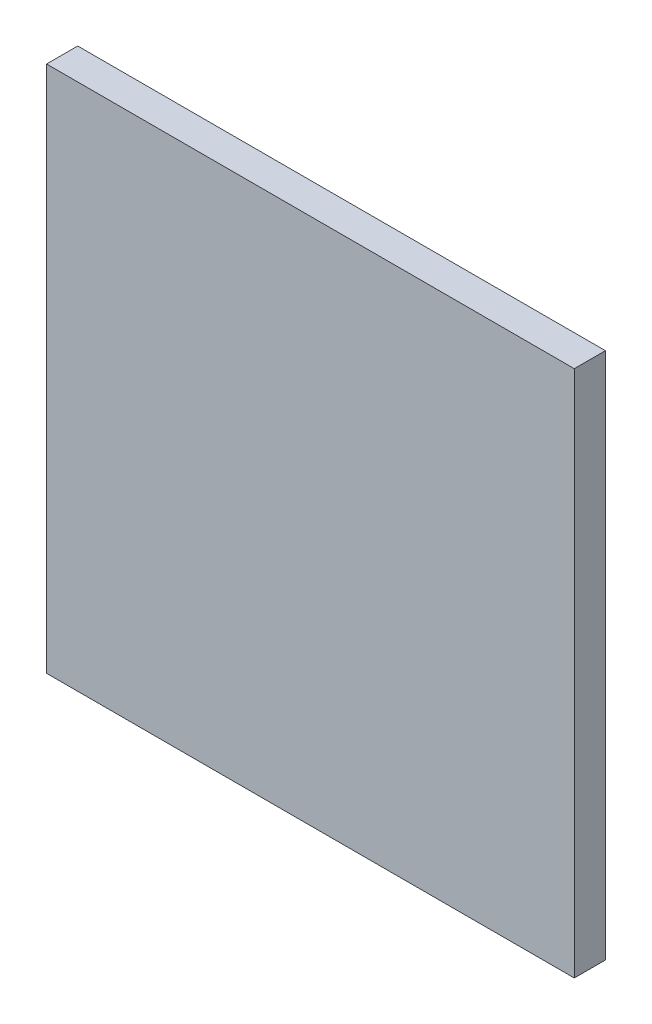
ISO-10303-21;
HEADER;
FILE_DESCRIPTION(('STEP AP214'),'2;1');
FILE_NAME('part.step','',(''),(''),'','','');
FILE_SCHEMA(('AUTOMOTIVE_DESIGN { 1 0 10303 214 1 1 1 1 }'));
ENDSEC;
DATA;
#1=APPLICATION_CONTEXT('core data for automotive mechanical design processes');
#2=APPLICATION_PROTOCOL_DEFINITION('international standard','automotive_design',2000,#1);
#3=PRODUCT_CONTEXT('',#1,'mechanical');
#4=PRODUCT('Part','Part','',(#3));
#5=PRODUCT_RELATED_PRODUCT_CATEGORY('part','',(#4));
#6=PRODUCT_DEFINITION_FORMATION('','',#4);
#7=PRODUCT_DEFINITION_CONTEXT('part definition',#1,'design');
#8=PRODUCT_DEFINITION('design','',#6,#7);
#9=PRODUCT_DEFINITION_SHAPE('','',#8);
#10=(LENGTH_UNIT() NAMED_UNIT(*) SI_UNIT(.MILLI.,.METRE.));
#11=(NAMED_UNIT(*) PLANE_ANGLE_UNIT() SI_UNIT($,.RADIAN.));
#12=(NAMED_UNIT(*) SI_UNIT($,.STERADIAN.) SOLID_ANGLE_UNIT());
#13=UNCERTAINTY_MEASURE_WITH_UNIT(LENGTH_MEASURE(1.E-05),#10,'distance_accuracy_value','');
#14=(GEOMETRIC_REPRESENTATION_CONTEXT(3) GLOBAL_UNCERTAINTY_ASSIGNED_CONTEXT((#13)) GLOBAL_UNIT_ASSIGNED_CONTEXT((#10,
#11,#12)) REPRESENTATION_CONTEXT('',''));
#15=CARTESIAN_POINT('',(0.,0.,0.));
#16=DIRECTION('',(0.,0.,1.));
#17=DIRECTION('',(1.,0.,0.));
#18=AXIS2_PLACEMENT_3D('',#15,#16,#17);
#19=CARTESIAN_POINT('',(-0.432,-0.432,0.));
#20=DIRECTION('',(0.,-1.,0.));
#21=DIRECTION('',(0.,0.,1.));
#22=AXIS2_PLACEMENT_3D('',#19,#20,#21);
#23=PLANE('',#22);
#24=DIRECTION('',(-1.,0.,0.));
#25=VECTOR('',#24,1.);
#26=CARTESIAN_POINT('',(0.432,-0.432,0.));
#27=LINE('',#26,#25);
#28=CARTESIAN_POINT('',(0.432,-0.432,0.));
#29=VERTEX_POINT('',#28);
#30=CARTESIAN_POINT('',(-0.432,-0.432,0.));
#31=VERTEX_POINT('',#30);
#32=EDGE_CURVE('E11',#29,#31,#27,.T.);
#33=ORIENTED_EDGE('',*,*,#32,.F.);
#34=DIRECTION('',(0.,0.,-1.));
#35=VECTOR('',#34,1.);
#36=CARTESIAN_POINT('',(0.432,-0.432,0.051));
#37=LINE('',#36,#35);
#38=CARTESIAN_POINT('',(0.432,-0.432,0.051));
#39=VERTEX_POINT('',#38);
#40=EDGE_CURVE('E24',#39,#29,#37,.T.);
#41=ORIENTED_EDGE('',*,*,#40,.F.);
#42=DIRECTION('',(1.,0.,0.));
#43=VECTOR('',#42,1.);
#44=CARTESIAN_POINT('',(-0.432,-0.432,0.051));
#45=LINE('',#44,#43);
#46=CARTESIAN_POINT('',(-0.432,-0.432,0.051));
#47=VERTEX_POINT('',#46);
#48=EDGE_CURVE('E88',#47,#39,#45,.T.);
#49=ORIENTED_EDGE('',*,*,#48,.F.);
#50=DIRECTION('',(0.,0.,1.));
#51=VECTOR('',#50,1.);
#52=CARTESIAN_POINT('',(-0.432,-0.432,0.));
#53=LINE('',#52,#51);
#54=EDGE_CURVE('E77',#31,#47,#53,.T.);
#55=ORIENTED_EDGE('',*,*,#54,.F.);
#56=EDGE_LOOP('',(#33,#41,#49,#55));
#57=FACE_BOUND('',#56,.T.);
#58=ADVANCED_FACE('F17',(#57),#23,.T.);
#59=CARTESIAN_POINT('',(0.432,-0.432,0.));
#60=DIRECTION('',(1.,0.,0.));
#61=DIRECTION('',(0.,0.,1.));
#62=AXIS2_PLACEMENT_3D('',#59,#60,#61);
#63=PLANE('',#62);
#64=DIRECTION('',(0.,-1.,0.));
#65=VECTOR('',#64,1.);
#66=CARTESIAN_POINT('',(0.432,0.432,0.));
#67=LINE('',#66,#65);
#68=CARTESIAN_POINT('',(0.432,0.432,0.));
#69=VERTEX_POINT('',#68);
#70=EDGE_CURVE('E85',#69,#29,#67,.T.);
#71=ORIENTED_EDGE('',*,*,#70,.F.);
#72=DIRECTION('',(0.,0.,-1.));
#73=VECTOR('',#72,1.);
#74=CARTESIAN_POINT('',(0.432,0.432,0.051));
#75=LINE('',#74,#73);
#76=CARTESIAN_POINT('',(0.432,0.432,0.051));
#77=VERTEX_POINT('',#76);
#78=EDGE_CURVE('E83',#77,#69,#75,.T.);
#79=ORIENTED_EDGE('',*,*,#78,.F.);
#80=DIRECTION('',(0.,1.,0.));
#81=VECTOR('',#80,1.);
#82=CARTESIAN_POINT('',(0.432,-0.432,0.051));
#83=LINE('',#82,#81);
#84=EDGE_CURVE('E72',#39,#77,#83,.T.);
#85=ORIENTED_EDGE('',*,*,#84,.F.);
#86=ORIENTED_EDGE('',*,*,#40,.T.);
#87=EDGE_LOOP('',(#71,#79,#85,#86));
#88=FACE_BOUND('',#87,.T.);
#89=ADVANCED_FACE('F90',(#88),#63,.T.);
#90=CARTESIAN_POINT('',(0.432,0.432,0.));
#91=DIRECTION('',(0.,1.,0.));
#92=DIRECTION('',(0.,0.,1.));
#93=AXIS2_PLACEMENT_3D('',#90,#91,#92);
#94=PLANE('',#93);
#95=DIRECTION('',(1.,0.,0.));
#96=VECTOR('',#95,1.);
#97=CARTESIAN_POINT('',(-0.432,0.432,0.));
#98=LINE('',#97,#96);
#99=CARTESIAN_POINT('',(-0.432,0.432,0.));
#100=VERTEX_POINT('',#99);
#101=EDGE_CURVE('E60',#100,#69,#98,.T.);
#102=ORIENTED_EDGE('',*,*,#101,.F.);
#103=DIRECTION('',(0.,0.,-1.));
#104=VECTOR('',#103,1.);
#105=CARTESIAN_POINT('',(-0.432,0.432,0.051));
#106=LINE('',#105,#104);
#107=CARTESIAN_POINT('',(-0.432,0.432,0.051));
#108=VERTEX_POINT('',#107);
#109=EDGE_CURVE('E54',#108,#100,#106,.T.);
#110=ORIENTED_EDGE('',*,*,#109,.F.);
#111=DIRECTION('',(-1.,0.,0.));
#112=VECTOR('',#111,1.);
#113=CARTESIAN_POINT('',(0.432,0.432,0.051));
#114=LINE('',#113,#112);
#115=EDGE_CURVE('E58',#77,#108,#114,.T.);
#116=ORIENTED_EDGE('',*,*,#115,.F.);
#117=ORIENTED_EDGE('',*,*,#78,.T.);
#118=EDGE_LOOP('',(#102,#110,#116,#117));
#119=FACE_BOUND('',#118,.T.);
#120=ADVANCED_FACE('F56',(#119),#94,.T.);
#121=CARTESIAN_POINT('',(-0.432,0.432,0.));
#122=DIRECTION('',(-1.,0.,0.));
#123=DIRECTION('',(0.,0.,1.));
#124=AXIS2_PLACEMENT_3D('',#121,#122,#123);
#125=PLANE('',#124);
#126=DIRECTION('',(0.,1.,0.));
#127=VECTOR('',#126,1.);
#128=CARTESIAN_POINT('',(-0.432,-0.432,0.));
#129=LINE('',#128,#127);
#130=EDGE_CURVE('E73',#31,#100,#129,.T.);
#131=ORIENTED_EDGE('',*,*,#130,.F.);
#132=ORIENTED_EDGE('',*,*,#54,.T.);
#133=DIRECTION('',(0.,-1.,0.));
#134=VECTOR('',#133,1.);
#135=CARTESIAN_POINT('',(-0.432,0.432,0.051));
#136=LINE('',#135,#134);
#137=EDGE_CURVE('E70',#108,#47,#136,.T.);
#138=ORIENTED_EDGE('',*,*,#137,.F.);
#139=ORIENTED_EDGE('',*,*,#109,.T.);
#140=EDGE_LOOP('',(#131,#132,#138,#139));
#141=FACE_BOUND('',#140,.T.);
#142=ADVANCED_FACE('F76',(#141),#125,.T.);
#143=CARTESIAN_POINT('',(-0.432,0.432,0.));
#144=DIRECTION('',(0.,0.,-1.));
#145=DIRECTION('',(0.,1.,0.));
#146=AXIS2_PLACEMENT_3D('',#143,#144,#145);
#147=PLANE('',#146);
#148=ORIENTED_EDGE('',*,*,#101,.T.);
#149=ORIENTED_EDGE('',*,*,#70,.T.);
#150=ORIENTED_EDGE('',*,*,#32,.T.);
#151=ORIENTED_EDGE('',*,*,#130,.T.);
#152=EDGE_LOOP('',(#148,#149,#150,#151));
#153=FACE_BOUND('',#152,.T.);
#154=ADVANCED_FACE('F91',(#153),#147,.T.);
#155=CARTESIAN_POINT('',(-0.432,-0.432,0.051));
#156=DIRECTION('',(0.,0.,1.));
#157=DIRECTION('',(0.,1.,0.));
#158=AXIS2_PLACEMENT_3D('',#155,#156,#157);
#159=PLANE('',#158);
#160=ORIENTED_EDGE('',*,*,#48,.T.);
#161=ORIENTED_EDGE('',*,*,#84,.T.);
#162=ORIENTED_EDGE('',*,*,#115,.T.);
#163=ORIENTED_EDGE('',*,*,#137,.T.);
#164=EDGE_LOOP('',(#160,#161,#162,#163));
#165=FACE_BOUND('',#164,.T.);
#166=ADVANCED_FACE('F69',(#165),#159,.T.);
#167=CLOSED_SHELL('',(#58,#89,#120,#142,#154,#166));
#168=MANIFOLD_SOLID_BREP('B1',#167);
#169=ADVANCED_BREP_SHAPE_REPRESENTATION('',(#18,#168),#14);
#170=SHAPE_DEFINITION_REPRESENTATION(#9,#169);
ENDSEC;
END-ISO-10303-21;
